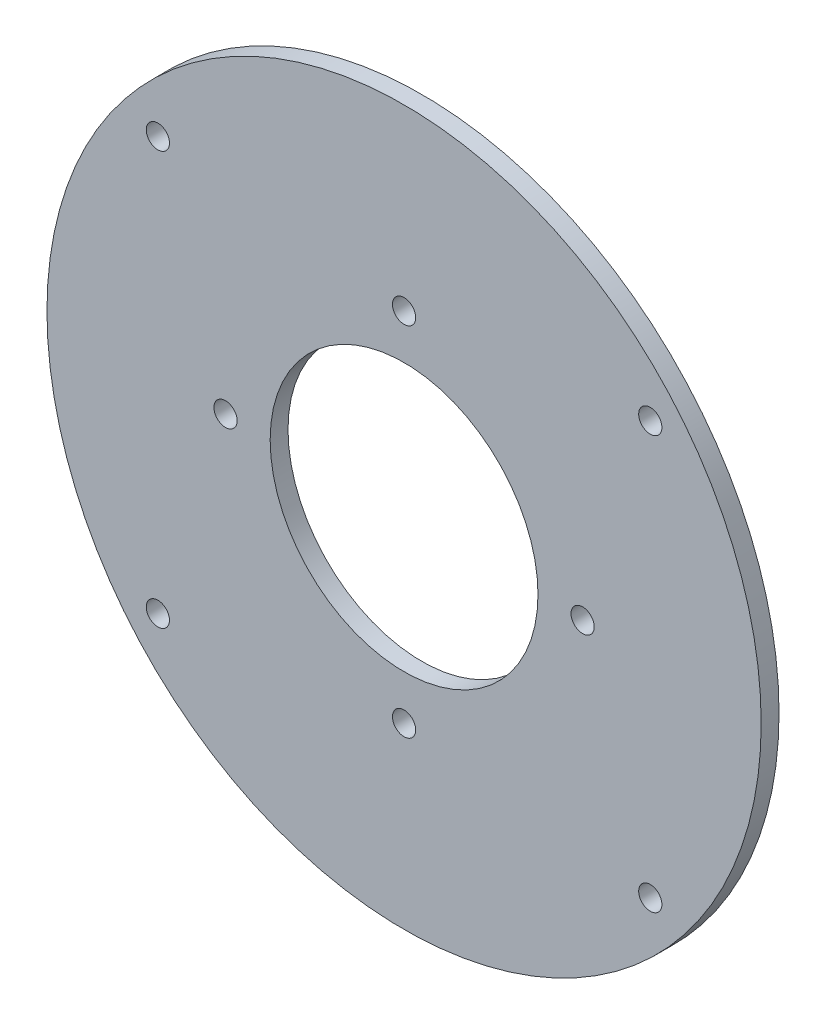
ISO-10303-21;
HEADER;
FILE_DESCRIPTION(('STEP AP214'),'2;1');
FILE_NAME('part.step','',(''),(''),'','','');
FILE_SCHEMA(('AUTOMOTIVE_DESIGN { 1 0 10303 214 1 1 1 1 }'));
ENDSEC;
DATA;
#1=APPLICATION_CONTEXT('core data for automotive mechanical design processes');
#2=APPLICATION_PROTOCOL_DEFINITION('international standard','automotive_design',2000,#1);
#3=PRODUCT_CONTEXT('',#1,'mechanical');
#4=PRODUCT('Part','Part','',(#3));
#5=PRODUCT_RELATED_PRODUCT_CATEGORY('part','',(#4));
#6=PRODUCT_DEFINITION_FORMATION('','',#4);
#7=PRODUCT_DEFINITION_CONTEXT('part definition',#1,'design');
#8=PRODUCT_DEFINITION('design','',#6,#7);
#9=PRODUCT_DEFINITION_SHAPE('','',#8);
#10=(LENGTH_UNIT() NAMED_UNIT(*) SI_UNIT(.MILLI.,.METRE.));
#11=(NAMED_UNIT(*) PLANE_ANGLE_UNIT() SI_UNIT($,.RADIAN.));
#12=(NAMED_UNIT(*) SI_UNIT($,.STERADIAN.) SOLID_ANGLE_UNIT());
#13=UNCERTAINTY_MEASURE_WITH_UNIT(LENGTH_MEASURE(1.E-05),#10,'distance_accuracy_value','');
#14=(GEOMETRIC_REPRESENTATION_CONTEXT(3) GLOBAL_UNCERTAINTY_ASSIGNED_CONTEXT((#13)) GLOBAL_UNIT_ASSIGNED_CONTEXT((#10,
#11,#12)) REPRESENTATION_CONTEXT('',''));
#15=CARTESIAN_POINT('',(0.,0.,0.));
#16=DIRECTION('',(0.,0.,1.));
#17=DIRECTION('',(1.,0.,0.));
#18=AXIS2_PLACEMENT_3D('',#15,#16,#17);
#19=CARTESIAN_POINT('',(0.,0.,4.));
#20=DIRECTION('',(0.,0.,1.));
#21=DIRECTION('',(1.,0.,0.));
#22=AXIS2_PLACEMENT_3D('',#19,#20,#21);
#23=PLANE('',#22);
#24=CARTESIAN_POINT('',(0.,40.,4.));
#25=DIRECTION('',(0.,0.,1.));
#26=DIRECTION('',(1.,0.,0.));
#27=AXIS2_PLACEMENT_3D('',#24,#25,#26);
#28=CIRCLE('',#27,2.6);
#29=CARTESIAN_POINT('',(2.59999999999998,40.,4.));
#30=VERTEX_POINT('',#29);
#31=EDGE_CURVE('E89',#30,#30,#28,.T.);
#32=ORIENTED_EDGE('',*,*,#31,.F.);
#33=EDGE_LOOP('',(#32));
#34=FACE_BOUND('',#33,.T.);
#35=CARTESIAN_POINT('',(0.,0.,4.));
#36=DIRECTION('',(0.,0.,1.));
#37=DIRECTION('',(1.,0.,0.));
#38=AXIS2_PLACEMENT_3D('',#35,#36,#37);
#39=CIRCLE('',#38,30.);
#40=CARTESIAN_POINT('',(30.,0.,4.));
#41=VERTEX_POINT('',#40);
#42=EDGE_CURVE('E77',#41,#41,#39,.T.);
#43=ORIENTED_EDGE('',*,*,#42,.F.);
#44=EDGE_LOOP('',(#43));
#45=FACE_BOUND('',#44,.T.);
#46=CARTESIAN_POINT('',(-55.1551999045668,-46.2807078974303,4.));
#47=DIRECTION('',(0.,0.,1.));
#48=DIRECTION('',(1.,0.,0.));
#49=AXIS2_PLACEMENT_3D('',#46,#47,#48);
#50=CIRCLE('',#49,2.6);
#51=CARTESIAN_POINT('',(-52.5551999045668,-46.2807078974303,4.));
#52=VERTEX_POINT('',#51);
#53=EDGE_CURVE('E65',#52,#52,#50,.T.);
#54=ORIENTED_EDGE('',*,*,#53,.F.);
#55=EDGE_LOOP('',(#54));
#56=FACE_BOUND('',#55,.T.);
#57=CARTESIAN_POINT('',(55.1551999045668,46.2807078974304,4.));
#58=DIRECTION('',(0.,0.,1.));
#59=DIRECTION('',(1.,0.,0.));
#60=AXIS2_PLACEMENT_3D('',#57,#58,#59);
#61=CIRCLE('',#60,2.6);
#62=CARTESIAN_POINT('',(57.7551999045668,46.2807078974304,4.));
#63=VERTEX_POINT('',#62);
#64=EDGE_CURVE('E53',#63,#63,#61,.T.);
#65=ORIENTED_EDGE('',*,*,#64,.F.);
#66=EDGE_LOOP('',(#65));
#67=FACE_BOUND('',#66,.T.);
#68=CARTESIAN_POINT('',(0.,0.,4.));
#69=DIRECTION('',(0.,0.,1.));
#70=DIRECTION('',(1.,0.,0.));
#71=AXIS2_PLACEMENT_3D('',#68,#69,#70);
#72=CIRCLE('',#71,80.);
#73=CARTESIAN_POINT('',(80.,0.,4.));
#74=VERTEX_POINT('',#73);
#75=EDGE_CURVE('E10',#74,#74,#72,.T.);
#76=ORIENTED_EDGE('',*,*,#75,.T.);
#77=EDGE_LOOP('',(#76));
#78=FACE_BOUND('',#77,.T.);
#79=CARTESIAN_POINT('',(-55.1551999045662,46.2807078974311,4.));
#80=DIRECTION('',(0.,0.,1.));
#81=DIRECTION('',(1.,0.,0.));
#82=AXIS2_PLACEMENT_3D('',#79,#80,#81);
#83=CIRCLE('',#82,2.6);
#84=CARTESIAN_POINT('',(-52.5551999045662,46.2807078974311,4.));
#85=VERTEX_POINT('',#84);
#86=EDGE_CURVE('E48',#85,#85,#83,.T.);
#87=ORIENTED_EDGE('',*,*,#86,.F.);
#88=EDGE_LOOP('',(#87));
#89=FACE_BOUND('',#88,.T.);
#90=CARTESIAN_POINT('',(55.1551999045662,-46.2807078974311,4.));
#91=DIRECTION('',(0.,0.,1.));
#92=DIRECTION('',(1.,0.,0.));
#93=AXIS2_PLACEMENT_3D('',#90,#91,#92);
#94=CIRCLE('',#93,2.6);
#95=CARTESIAN_POINT('',(57.7551999045662,-46.2807078974311,4.));
#96=VERTEX_POINT('',#95);
#97=EDGE_CURVE('E59',#96,#96,#94,.T.);
#98=ORIENTED_EDGE('',*,*,#97,.F.);
#99=EDGE_LOOP('',(#98));
#100=FACE_BOUND('',#99,.T.);
#101=CARTESIAN_POINT('',(0.,-40.,4.));
#102=DIRECTION('',(0.,0.,1.));
#103=DIRECTION('',(1.,0.,0.));
#104=AXIS2_PLACEMENT_3D('',#101,#102,#103);
#105=CIRCLE('',#104,2.6);
#106=CARTESIAN_POINT('',(2.60000000000001,-40.,4.));
#107=VERTEX_POINT('',#106);
#108=EDGE_CURVE('E71',#107,#107,#105,.T.);
#109=ORIENTED_EDGE('',*,*,#108,.F.);
#110=EDGE_LOOP('',(#109));
#111=FACE_BOUND('',#110,.T.);
#112=CARTESIAN_POINT('',(-40.,0.,4.));
#113=DIRECTION('',(0.,0.,1.));
#114=DIRECTION('',(1.,0.,0.));
#115=AXIS2_PLACEMENT_3D('',#112,#113,#114);
#116=CIRCLE('',#115,2.6);
#117=CARTESIAN_POINT('',(-37.4,0.,4.));
#118=VERTEX_POINT('',#117);
#119=EDGE_CURVE('E83',#118,#118,#116,.T.);
#120=ORIENTED_EDGE('',*,*,#119,.F.);
#121=EDGE_LOOP('',(#120));
#122=FACE_BOUND('',#121,.T.);
#123=CARTESIAN_POINT('',(40.,0.,4.));
#124=DIRECTION('',(0.,0.,1.));
#125=DIRECTION('',(1.,0.,0.));
#126=AXIS2_PLACEMENT_3D('',#123,#124,#125);
#127=CIRCLE('',#126,2.6);
#128=CARTESIAN_POINT('',(42.6,0.,4.));
#129=VERTEX_POINT('',#128);
#130=EDGE_CURVE('E95',#129,#129,#127,.T.);
#131=ORIENTED_EDGE('',*,*,#130,.F.);
#132=EDGE_LOOP('',(#131));
#133=FACE_BOUND('',#132,.T.);
#134=ADVANCED_FACE('F37',(#34,#45,#56,#67,#78,#89,#100,#111,#122,#133),#23,.T.);
#135=CARTESIAN_POINT('',(0.,0.,0.));
#136=DIRECTION('',(0.,0.,1.));
#137=DIRECTION('',(1.,0.,0.));
#138=AXIS2_PLACEMENT_3D('',#135,#136,#137);
#139=PLANE('',#138);
#140=CARTESIAN_POINT('',(0.,0.,0.));
#141=DIRECTION('',(0.,0.,1.));
#142=DIRECTION('',(1.,0.,0.));
#143=AXIS2_PLACEMENT_3D('',#140,#141,#142);
#144=CIRCLE('',#143,80.);
#145=CARTESIAN_POINT('',(80.,0.,0.));
#146=VERTEX_POINT('',#145);
#147=EDGE_CURVE('E41',#146,#146,#144,.T.);
#148=ORIENTED_EDGE('',*,*,#147,.F.);
#149=EDGE_LOOP('',(#148));
#150=FACE_BOUND('',#149,.T.);
#151=CARTESIAN_POINT('',(-55.1551999045662,46.2807078974311,0.));
#152=DIRECTION('',(0.,0.,1.));
#153=DIRECTION('',(1.,0.,0.));
#154=AXIS2_PLACEMENT_3D('',#151,#152,#153);
#155=CIRCLE('',#154,2.6);
#156=CARTESIAN_POINT('',(-52.5551999045662,46.2807078974311,0.));
#157=VERTEX_POINT('',#156);
#158=EDGE_CURVE('E50',#157,#157,#155,.T.);
#159=ORIENTED_EDGE('',*,*,#158,.T.);
#160=EDGE_LOOP('',(#159));
#161=FACE_BOUND('',#160,.T.);
#162=CARTESIAN_POINT('',(55.1551999045668,46.2807078974304,0.));
#163=DIRECTION('',(0.,0.,1.));
#164=DIRECTION('',(1.,0.,0.));
#165=AXIS2_PLACEMENT_3D('',#162,#163,#164);
#166=CIRCLE('',#165,2.6);
#167=CARTESIAN_POINT('',(57.7551999045668,46.2807078974304,0.));
#168=VERTEX_POINT('',#167);
#169=EDGE_CURVE('E56',#168,#168,#166,.T.);
#170=ORIENTED_EDGE('',*,*,#169,.T.);
#171=EDGE_LOOP('',(#170));
#172=FACE_BOUND('',#171,.T.);
#173=CARTESIAN_POINT('',(55.1551999045662,-46.2807078974311,0.));
#174=DIRECTION('',(0.,0.,1.));
#175=DIRECTION('',(1.,0.,0.));
#176=AXIS2_PLACEMENT_3D('',#173,#174,#175);
#177=CIRCLE('',#176,2.6);
#178=CARTESIAN_POINT('',(57.7551999045662,-46.2807078974311,0.));
#179=VERTEX_POINT('',#178);
#180=EDGE_CURVE('E62',#179,#179,#177,.T.);
#181=ORIENTED_EDGE('',*,*,#180,.T.);
#182=EDGE_LOOP('',(#181));
#183=FACE_BOUND('',#182,.T.);
#184=CARTESIAN_POINT('',(-55.1551999045668,-46.2807078974303,0.));
#185=DIRECTION('',(0.,0.,1.));
#186=DIRECTION('',(1.,0.,0.));
#187=AXIS2_PLACEMENT_3D('',#184,#185,#186);
#188=CIRCLE('',#187,2.6);
#189=CARTESIAN_POINT('',(-52.5551999045668,-46.2807078974303,0.));
#190=VERTEX_POINT('',#189);
#191=EDGE_CURVE('E68',#190,#190,#188,.T.);
#192=ORIENTED_EDGE('',*,*,#191,.T.);
#193=EDGE_LOOP('',(#192));
#194=FACE_BOUND('',#193,.T.);
#195=CARTESIAN_POINT('',(0.,-40.,0.));
#196=DIRECTION('',(0.,0.,1.));
#197=DIRECTION('',(1.,0.,0.));
#198=AXIS2_PLACEMENT_3D('',#195,#196,#197);
#199=CIRCLE('',#198,2.6);
#200=CARTESIAN_POINT('',(2.60000000000001,-40.,0.));
#201=VERTEX_POINT('',#200);
#202=EDGE_CURVE('E74',#201,#201,#199,.T.);
#203=ORIENTED_EDGE('',*,*,#202,.T.);
#204=EDGE_LOOP('',(#203));
#205=FACE_BOUND('',#204,.T.);
#206=CARTESIAN_POINT('',(0.,0.,0.));
#207=DIRECTION('',(0.,0.,1.));
#208=DIRECTION('',(1.,0.,0.));
#209=AXIS2_PLACEMENT_3D('',#206,#207,#208);
#210=CIRCLE('',#209,30.);
#211=CARTESIAN_POINT('',(30.,0.,0.));
#212=VERTEX_POINT('',#211);
#213=EDGE_CURVE('E80',#212,#212,#210,.T.);
#214=ORIENTED_EDGE('',*,*,#213,.T.);
#215=EDGE_LOOP('',(#214));
#216=FACE_BOUND('',#215,.T.);
#217=CARTESIAN_POINT('',(-40.,0.,0.));
#218=DIRECTION('',(0.,0.,1.));
#219=DIRECTION('',(1.,0.,0.));
#220=AXIS2_PLACEMENT_3D('',#217,#218,#219);
#221=CIRCLE('',#220,2.6);
#222=CARTESIAN_POINT('',(-37.4,0.,0.));
#223=VERTEX_POINT('',#222);
#224=EDGE_CURVE('E86',#223,#223,#221,.T.);
#225=ORIENTED_EDGE('',*,*,#224,.T.);
#226=EDGE_LOOP('',(#225));
#227=FACE_BOUND('',#226,.T.);
#228=CARTESIAN_POINT('',(0.,40.,0.));
#229=DIRECTION('',(0.,0.,1.));
#230=DIRECTION('',(1.,0.,0.));
#231=AXIS2_PLACEMENT_3D('',#228,#229,#230);
#232=CIRCLE('',#231,2.6);
#233=CARTESIAN_POINT('',(2.59999999999998,40.,0.));
#234=VERTEX_POINT('',#233);
#235=EDGE_CURVE('E92',#234,#234,#232,.T.);
#236=ORIENTED_EDGE('',*,*,#235,.T.);
#237=EDGE_LOOP('',(#236));
#238=FACE_BOUND('',#237,.T.);
#239=CARTESIAN_POINT('',(40.,0.,0.));
#240=DIRECTION('',(0.,0.,1.));
#241=DIRECTION('',(1.,0.,0.));
#242=AXIS2_PLACEMENT_3D('',#239,#240,#241);
#243=CIRCLE('',#242,2.6);
#244=CARTESIAN_POINT('',(42.6,0.,0.));
#245=VERTEX_POINT('',#244);
#246=EDGE_CURVE('E98',#245,#245,#243,.T.);
#247=ORIENTED_EDGE('',*,*,#246,.T.);
#248=EDGE_LOOP('',(#247));
#249=FACE_BOUND('',#248,.T.);
#250=ADVANCED_FACE('F108',(#150,#161,#172,#183,#194,#205,#216,#227,#238,#249),#139,.F.);
#251=CARTESIAN_POINT('',(0.,0.,4.));
#252=DIRECTION('',(0.,0.,-1.));
#253=DIRECTION('',(-1.,0.,0.));
#254=AXIS2_PLACEMENT_3D('',#251,#252,#253);
#255=CYLINDRICAL_SURFACE('',#254,80.);
#256=ORIENTED_EDGE('',*,*,#75,.F.);
#257=EDGE_LOOP('',(#256));
#258=FACE_BOUND('',#257,.T.);
#259=ORIENTED_EDGE('',*,*,#147,.T.);
#260=EDGE_LOOP('',(#259));
#261=FACE_BOUND('',#260,.T.);
#262=ADVANCED_FACE('F39',(#258,#261),#255,.T.);
#263=CARTESIAN_POINT('',(-55.1551999045662,46.2807078974311,4.));
#264=DIRECTION('',(0.,0.,-1.));
#265=DIRECTION('',(-1.,0.,0.));
#266=AXIS2_PLACEMENT_3D('',#263,#264,#265);
#267=CYLINDRICAL_SURFACE('',#266,2.6);
#268=ORIENTED_EDGE('',*,*,#86,.T.);
#269=EDGE_LOOP('',(#268));
#270=FACE_BOUND('',#269,.T.);
#271=ORIENTED_EDGE('',*,*,#158,.F.);
#272=EDGE_LOOP('',(#271));
#273=FACE_BOUND('',#272,.T.);
#274=ADVANCED_FACE('F118',(#270,#273),#267,.F.);
#275=CARTESIAN_POINT('',(55.1551999045668,46.2807078974304,4.));
#276=DIRECTION('',(0.,0.,-1.));
#277=DIRECTION('',(-1.,0.,0.));
#278=AXIS2_PLACEMENT_3D('',#275,#276,#277);
#279=CYLINDRICAL_SURFACE('',#278,2.6);
#280=ORIENTED_EDGE('',*,*,#64,.T.);
#281=EDGE_LOOP('',(#280));
#282=FACE_BOUND('',#281,.T.);
#283=ORIENTED_EDGE('',*,*,#169,.F.);
#284=EDGE_LOOP('',(#283));
#285=FACE_BOUND('',#284,.T.);
#286=ADVANCED_FACE('F121',(#282,#285),#279,.F.);
#287=CARTESIAN_POINT('',(55.1551999045662,-46.2807078974311,4.));
#288=DIRECTION('',(0.,0.,-1.));
#289=DIRECTION('',(-1.,0.,0.));
#290=AXIS2_PLACEMENT_3D('',#287,#288,#289);
#291=CYLINDRICAL_SURFACE('',#290,2.6);
#292=ORIENTED_EDGE('',*,*,#97,.T.);
#293=EDGE_LOOP('',(#292));
#294=FACE_BOUND('',#293,.T.);
#295=ORIENTED_EDGE('',*,*,#180,.F.);
#296=EDGE_LOOP('',(#295));
#297=FACE_BOUND('',#296,.T.);
#298=ADVANCED_FACE('F125',(#294,#297),#291,.F.);
#299=CARTESIAN_POINT('',(-55.1551999045668,-46.2807078974303,4.));
#300=DIRECTION('',(0.,0.,-1.));
#301=DIRECTION('',(-1.,0.,0.));
#302=AXIS2_PLACEMENT_3D('',#299,#300,#301);
#303=CYLINDRICAL_SURFACE('',#302,2.6);
#304=ORIENTED_EDGE('',*,*,#53,.T.);
#305=EDGE_LOOP('',(#304));
#306=FACE_BOUND('',#305,.T.);
#307=ORIENTED_EDGE('',*,*,#191,.F.);
#308=EDGE_LOOP('',(#307));
#309=FACE_BOUND('',#308,.T.);
#310=ADVANCED_FACE('F129',(#306,#309),#303,.F.);
#311=CARTESIAN_POINT('',(0.,-40.,4.));
#312=DIRECTION('',(0.,0.,-1.));
#313=DIRECTION('',(-1.,0.,0.));
#314=AXIS2_PLACEMENT_3D('',#311,#312,#313);
#315=CYLINDRICAL_SURFACE('',#314,2.6);
#316=ORIENTED_EDGE('',*,*,#108,.T.);
#317=EDGE_LOOP('',(#316));
#318=FACE_BOUND('',#317,.T.);
#319=ORIENTED_EDGE('',*,*,#202,.F.);
#320=EDGE_LOOP('',(#319));
#321=FACE_BOUND('',#320,.T.);
#322=ADVANCED_FACE('F133',(#318,#321),#315,.F.);
#323=CARTESIAN_POINT('',(0.,0.,4.));
#324=DIRECTION('',(0.,0.,-1.));
#325=DIRECTION('',(-1.,0.,0.));
#326=AXIS2_PLACEMENT_3D('',#323,#324,#325);
#327=CYLINDRICAL_SURFACE('',#326,30.);
#328=ORIENTED_EDGE('',*,*,#42,.T.);
#329=EDGE_LOOP('',(#328));
#330=FACE_BOUND('',#329,.T.);
#331=ORIENTED_EDGE('',*,*,#213,.F.);
#332=EDGE_LOOP('',(#331));
#333=FACE_BOUND('',#332,.T.);
#334=ADVANCED_FACE('F137',(#330,#333),#327,.F.);
#335=CARTESIAN_POINT('',(-40.,0.,4.));
#336=DIRECTION('',(0.,0.,-1.));
#337=DIRECTION('',(-1.,0.,0.));
#338=AXIS2_PLACEMENT_3D('',#335,#336,#337);
#339=CYLINDRICAL_SURFACE('',#338,2.6);
#340=ORIENTED_EDGE('',*,*,#119,.T.);
#341=EDGE_LOOP('',(#340));
#342=FACE_BOUND('',#341,.T.);
#343=ORIENTED_EDGE('',*,*,#224,.F.);
#344=EDGE_LOOP('',(#343));
#345=FACE_BOUND('',#344,.T.);
#346=ADVANCED_FACE('F141',(#342,#345),#339,.F.);
#347=CARTESIAN_POINT('',(0.,40.,4.));
#348=DIRECTION('',(0.,0.,-1.));
#349=DIRECTION('',(-1.,0.,0.));
#350=AXIS2_PLACEMENT_3D('',#347,#348,#349);
#351=CYLINDRICAL_SURFACE('',#350,2.6);
#352=ORIENTED_EDGE('',*,*,#31,.T.);
#353=EDGE_LOOP('',(#352));
#354=FACE_BOUND('',#353,.T.);
#355=ORIENTED_EDGE('',*,*,#235,.F.);
#356=EDGE_LOOP('',(#355));
#357=FACE_BOUND('',#356,.T.);
#358=ADVANCED_FACE('F145',(#354,#357),#351,.F.);
#359=CARTESIAN_POINT('',(40.,0.,4.));
#360=DIRECTION('',(0.,0.,-1.));
#361=DIRECTION('',(-1.,0.,0.));
#362=AXIS2_PLACEMENT_3D('',#359,#360,#361);
#363=CYLINDRICAL_SURFACE('',#362,2.6);
#364=ORIENTED_EDGE('',*,*,#130,.T.);
#365=EDGE_LOOP('',(#364));
#366=FACE_BOUND('',#365,.T.);
#367=ORIENTED_EDGE('',*,*,#246,.F.);
#368=EDGE_LOOP('',(#367));
#369=FACE_BOUND('',#368,.T.);
#370=ADVANCED_FACE('F104',(#366,#369),#363,.F.);
#371=CLOSED_SHELL('',(#134,#250,#262,#274,#286,#298,#310,#322,#334,#346,#358,#370));
#372=MANIFOLD_SOLID_BREP('B2',#371);
#373=ADVANCED_BREP_SHAPE_REPRESENTATION('',(#18,#372),#14);
#374=SHAPE_DEFINITION_REPRESENTATION(#9,#373);
ENDSEC;
END-ISO-10303-21;
